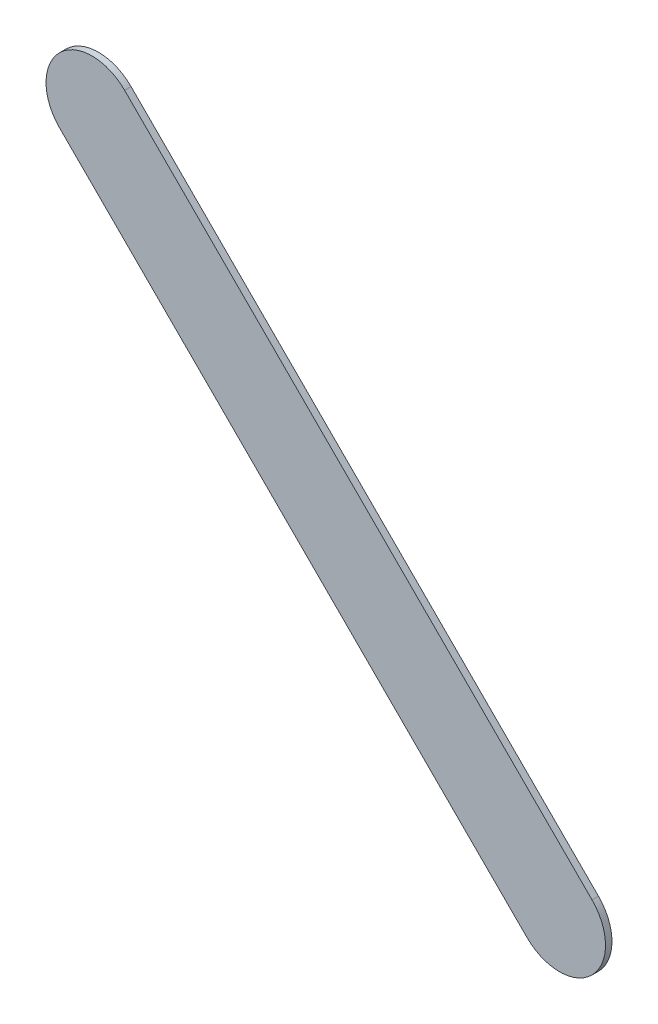
ISO-10303-21;
HEADER;
FILE_DESCRIPTION(('STEP AP214'),'2;1');
FILE_NAME('part.step','',(''),(''),'','','');
FILE_SCHEMA(('AUTOMOTIVE_DESIGN { 1 0 10303 214 1 1 1 1 }'));
ENDSEC;
DATA;
#1=APPLICATION_CONTEXT('core data for automotive mechanical design processes');
#2=APPLICATION_PROTOCOL_DEFINITION('international standard','automotive_design',2000,#1);
#3=PRODUCT_CONTEXT('',#1,'mechanical');
#4=PRODUCT('Part','Part','',(#3));
#5=PRODUCT_RELATED_PRODUCT_CATEGORY('part','',(#4));
#6=PRODUCT_DEFINITION_FORMATION('','',#4);
#7=PRODUCT_DEFINITION_CONTEXT('part definition',#1,'design');
#8=PRODUCT_DEFINITION('design','',#6,#7);
#9=PRODUCT_DEFINITION_SHAPE('','',#8);
#10=(LENGTH_UNIT() NAMED_UNIT(*) SI_UNIT(.MILLI.,.METRE.));
#11=(NAMED_UNIT(*) PLANE_ANGLE_UNIT() SI_UNIT($,.RADIAN.));
#12=(NAMED_UNIT(*) SI_UNIT($,.STERADIAN.) SOLID_ANGLE_UNIT());
#13=UNCERTAINTY_MEASURE_WITH_UNIT(LENGTH_MEASURE(1.E-05),#10,'distance_accuracy_value','');
#14=(GEOMETRIC_REPRESENTATION_CONTEXT(3) GLOBAL_UNCERTAINTY_ASSIGNED_CONTEXT((#13)) GLOBAL_UNIT_ASSIGNED_CONTEXT((#10,
#11,#12)) REPRESENTATION_CONTEXT('',''));
#15=CARTESIAN_POINT('',(0.,0.,0.));
#16=DIRECTION('',(0.,0.,1.));
#17=DIRECTION('',(1.,0.,0.));
#18=AXIS2_PLACEMENT_3D('',#15,#16,#17);
#19=CARTESIAN_POINT('',(170.356776,-93.803223,0.));
#20=DIRECTION('',(0.,0.,1.));
#21=DIRECTION('',(1.,0.,0.));
#22=AXIS2_PLACEMENT_3D('',#19,#20,#21);
#23=PLANE('',#22);
#24=DIRECTION('',(-0.707106781186548,0.707106781186548,0.));
#25=VECTOR('',#24,1.);
#26=CARTESIAN_POINT('',(170.356776,-93.803223,0.));
#27=LINE('',#26,#25);
#28=CARTESIAN_POINT('',(170.356776,-93.803223,0.));
#29=VERTEX_POINT('',#28);
#30=CARTESIAN_POINT('',(167.816776,-91.263223,0.));
#31=VERTEX_POINT('',#30);
#32=EDGE_CURVE('E80',#29,#31,#27,.T.);
#33=ORIENTED_EDGE('',*,*,#32,.T.);
#34=CARTESIAN_POINT('',(167.6399995,-91.4399995,0.));
#35=DIRECTION('',(0.,0.,1.));
#36=DIRECTION('',(0.707106781186548,0.707106781186548,0.));
#37=AXIS2_PLACEMENT_3D('',#34,#35,#36);
#38=CIRCLE('',#37,0.249999723809);
#39=CARTESIAN_POINT('',(167.463223,-91.616776,0.));
#40=VERTEX_POINT('',#39);
#41=EDGE_CURVE('E78',#31,#40,#38,.T.);
#42=ORIENTED_EDGE('',*,*,#41,.T.);
#43=DIRECTION('',(0.707106781186548,-0.707106781186548,0.));
#44=VECTOR('',#43,1.);
#45=CARTESIAN_POINT('',(167.463223,-91.616776,0.));
#46=LINE('',#45,#44);
#47=CARTESIAN_POINT('',(170.003223,-94.156776,0.));
#48=VERTEX_POINT('',#47);
#49=EDGE_CURVE('E67',#40,#48,#46,.T.);
#50=ORIENTED_EDGE('',*,*,#49,.T.);
#51=CARTESIAN_POINT('',(170.1799995,-93.9799995,0.));
#52=DIRECTION('',(0.,0.,1.));
#53=DIRECTION('',(-0.707106781186548,-0.707106781186548,0.));
#54=AXIS2_PLACEMENT_3D('',#51,#52,#53);
#55=CIRCLE('',#54,0.249999723809);
#56=EDGE_CURVE('E11',#48,#29,#55,.T.);
#57=ORIENTED_EDGE('',*,*,#56,.T.);
#58=EDGE_LOOP('',(#33,#42,#50,#57));
#59=FACE_BOUND('',#58,.T.);
#60=ADVANCED_FACE('F17',(#59),#23,.T.);
#61=CARTESIAN_POINT('',(170.356776,-93.803223,-0.035));
#62=DIRECTION('',(0.,0.,1.));
#63=DIRECTION('',(1.,0.,0.));
#64=AXIS2_PLACEMENT_3D('',#61,#62,#63);
#65=PLANE('',#64);
#66=CARTESIAN_POINT('',(170.1799995,-93.9799995,-0.035));
#67=DIRECTION('',(0.,0.,1.));
#68=DIRECTION('',(-0.707106781186548,-0.707106781186548,0.));
#69=AXIS2_PLACEMENT_3D('',#66,#67,#68);
#70=CIRCLE('',#69,0.249999723809);
#71=CARTESIAN_POINT('',(170.003223,-94.156776,-0.035));
#72=VERTEX_POINT('',#71);
#73=CARTESIAN_POINT('',(170.356776,-93.803223,-0.035));
#74=VERTEX_POINT('',#73);
#75=EDGE_CURVE('E27',#72,#74,#70,.T.);
#76=ORIENTED_EDGE('',*,*,#75,.F.);
#77=DIRECTION('',(0.707106781186548,-0.707106781186548,0.));
#78=VECTOR('',#77,1.);
#79=CARTESIAN_POINT('',(167.463223,-91.616776,-0.035));
#80=LINE('',#79,#78);
#81=CARTESIAN_POINT('',(167.463223,-91.616776,-0.035));
#82=VERTEX_POINT('',#81);
#83=EDGE_CURVE('E85',#82,#72,#80,.T.);
#84=ORIENTED_EDGE('',*,*,#83,.F.);
#85=CARTESIAN_POINT('',(167.6399995,-91.4399995,-0.035));
#86=DIRECTION('',(0.,0.,1.));
#87=DIRECTION('',(0.707106781186548,0.707106781186548,0.));
#88=AXIS2_PLACEMENT_3D('',#85,#86,#87);
#89=CIRCLE('',#88,0.249999723809);
#90=CARTESIAN_POINT('',(167.816776,-91.263223,-0.035));
#91=VERTEX_POINT('',#90);
#92=EDGE_CURVE('E88',#91,#82,#89,.T.);
#93=ORIENTED_EDGE('',*,*,#92,.F.);
#94=DIRECTION('',(-0.707106781186548,0.707106781186548,0.));
#95=VECTOR('',#94,1.);
#96=CARTESIAN_POINT('',(170.356776,-93.803223,-0.035));
#97=LINE('',#96,#95);
#98=EDGE_CURVE('E192',#74,#91,#97,.T.);
#99=ORIENTED_EDGE('',*,*,#98,.F.);
#100=EDGE_LOOP('',(#76,#84,#93,#99));
#101=FACE_BOUND('',#100,.T.);
#102=ADVANCED_FACE('F155',(#101),#65,.F.);
#103=CARTESIAN_POINT('',(170.1799995,-93.9799995,-0.035));
#104=DIRECTION('',(0.,0.,-1.));
#105=DIRECTION('',(-0.707106781186548,-0.707106781186548,0.));
#106=AXIS2_PLACEMENT_3D('',#103,#104,#105);
#107=CYLINDRICAL_SURFACE('',#106,0.249999723809);
#108=ORIENTED_EDGE('',*,*,#75,.T.);
#109=DIRECTION('',(0.,0.,1.));
#110=VECTOR('',#109,1.);
#111=CARTESIAN_POINT('',(170.356776,-93.803223,-0.035));
#112=LINE('',#111,#110);
#113=EDGE_CURVE('E95',#74,#29,#112,.T.);
#114=ORIENTED_EDGE('',*,*,#113,.T.);
#115=ORIENTED_EDGE('',*,*,#56,.F.);
#116=DIRECTION('',(0.,0.,1.));
#117=VECTOR('',#116,1.);
#118=CARTESIAN_POINT('',(170.003223,-94.156776,-0.035));
#119=LINE('',#118,#117);
#120=EDGE_CURVE('E20',#72,#48,#119,.T.);
#121=ORIENTED_EDGE('',*,*,#120,.F.);
#122=EDGE_LOOP('',(#108,#114,#115,#121));
#123=FACE_BOUND('',#122,.T.);
#124=ADVANCED_FACE('F146',(#123),#107,.T.);
#125=CARTESIAN_POINT('',(167.463223,-91.616776,-0.035));
#126=DIRECTION('',(0.707106781186548,0.707106781186548,0.));
#127=DIRECTION('',(0.,0.,-1.));
#128=AXIS2_PLACEMENT_3D('',#125,#126,#127);
#129=PLANE('',#128);
#130=ORIENTED_EDGE('',*,*,#83,.T.);
#131=ORIENTED_EDGE('',*,*,#120,.T.);
#132=ORIENTED_EDGE('',*,*,#49,.F.);
#133=DIRECTION('',(0.,0.,1.));
#134=VECTOR('',#133,1.);
#135=CARTESIAN_POINT('',(167.463223,-91.616776,-0.035));
#136=LINE('',#135,#134);
#137=EDGE_CURVE('E72',#82,#40,#136,.T.);
#138=ORIENTED_EDGE('',*,*,#137,.F.);
#139=EDGE_LOOP('',(#130,#131,#132,#138));
#140=FACE_BOUND('',#139,.T.);
#141=ADVANCED_FACE('F70',(#140),#129,.F.);
#142=CARTESIAN_POINT('',(167.6399995,-91.4399995,-0.035));
#143=DIRECTION('',(0.,0.,-1.));
#144=DIRECTION('',(0.707106781186548,0.707106781186548,0.));
#145=AXIS2_PLACEMENT_3D('',#142,#143,#144);
#146=CYLINDRICAL_SURFACE('',#145,0.249999723809);
#147=ORIENTED_EDGE('',*,*,#92,.T.);
#148=ORIENTED_EDGE('',*,*,#137,.T.);
#149=ORIENTED_EDGE('',*,*,#41,.F.);
#150=DIRECTION('',(0.,0.,1.));
#151=VECTOR('',#150,1.);
#152=CARTESIAN_POINT('',(167.816776,-91.263223,-0.035));
#153=LINE('',#152,#151);
#154=EDGE_CURVE('E198',#91,#31,#153,.T.);
#155=ORIENTED_EDGE('',*,*,#154,.F.);
#156=EDGE_LOOP('',(#147,#148,#149,#155));
#157=FACE_BOUND('',#156,.T.);
#158=ADVANCED_FACE('F87',(#157),#146,.T.);
#159=CARTESIAN_POINT('',(170.356776,-93.803223,-0.035));
#160=DIRECTION('',(-0.707106781186548,-0.707106781186548,0.));
#161=DIRECTION('',(-0.707106781186548,0.707106781186548,0.));
#162=AXIS2_PLACEMENT_3D('',#159,#160,#161);
#163=PLANE('',#162);
#164=ORIENTED_EDGE('',*,*,#98,.T.);
#165=ORIENTED_EDGE('',*,*,#154,.T.);
#166=ORIENTED_EDGE('',*,*,#32,.F.);
#167=ORIENTED_EDGE('',*,*,#113,.F.);
#168=EDGE_LOOP('',(#164,#165,#166,#167));
#169=FACE_BOUND('',#168,.T.);
#170=ADVANCED_FACE('F122',(#169),#163,.F.);
#171=CLOSED_SHELL('',(#60,#102,#124,#141,#158,#170));
#172=MANIFOLD_SOLID_BREP('B1',#171);
#173=ADVANCED_BREP_SHAPE_REPRESENTATION('',(#18,#172),#14);
#174=SHAPE_DEFINITION_REPRESENTATION(#9,#173);
ENDSEC;
END-ISO-10303-21;
